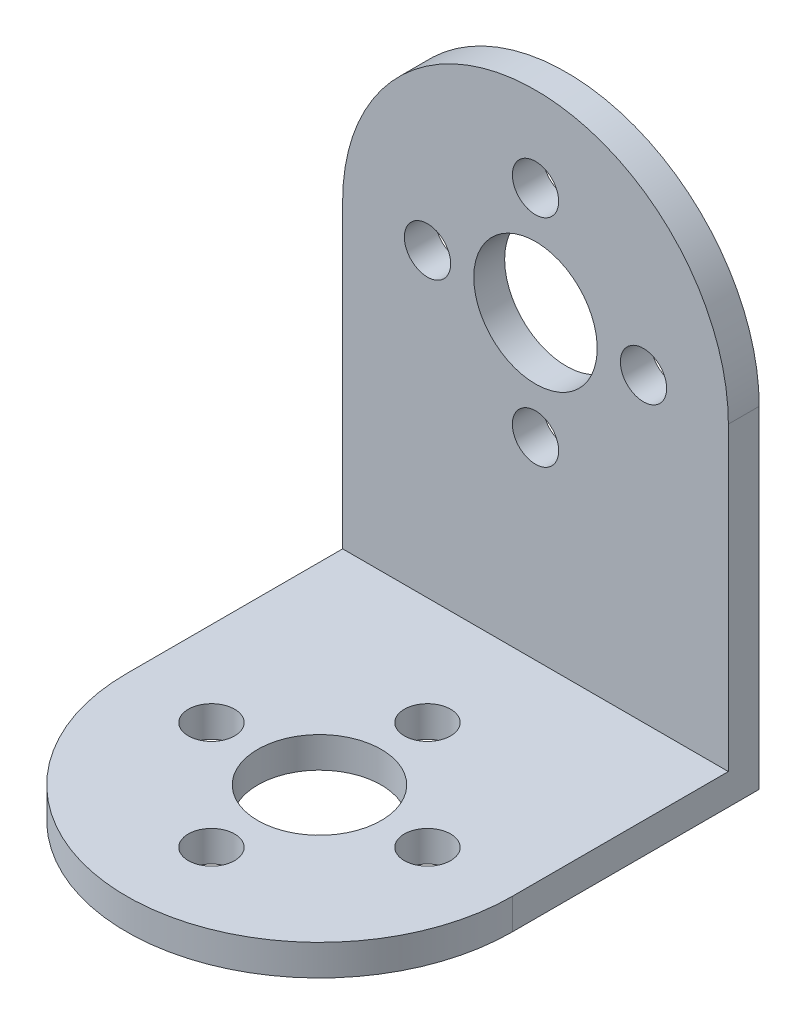
ISO-10303-21;
HEADER;
FILE_DESCRIPTION(('STEP AP214'),'2;1');
FILE_NAME('part.step','',(''),(''),'','','');
FILE_SCHEMA(('AUTOMOTIVE_DESIGN { 1 0 10303 214 1 1 1 1 }'));
ENDSEC;
DATA;
#1=APPLICATION_CONTEXT('core data for automotive mechanical design processes');
#2=APPLICATION_PROTOCOL_DEFINITION('international standard','automotive_design',2000,#1);
#3=PRODUCT_CONTEXT('',#1,'mechanical');
#4=PRODUCT('Part','Part','',(#3));
#5=PRODUCT_RELATED_PRODUCT_CATEGORY('part','',(#4));
#6=PRODUCT_DEFINITION_FORMATION('','',#4);
#7=PRODUCT_DEFINITION_CONTEXT('part definition',#1,'design');
#8=PRODUCT_DEFINITION('design','',#6,#7);
#9=PRODUCT_DEFINITION_SHAPE('','',#8);
#10=(LENGTH_UNIT() NAMED_UNIT(*) SI_UNIT(.MILLI.,.METRE.));
#11=(NAMED_UNIT(*) PLANE_ANGLE_UNIT() SI_UNIT($,.RADIAN.));
#12=(NAMED_UNIT(*) SI_UNIT($,.STERADIAN.) SOLID_ANGLE_UNIT());
#13=UNCERTAINTY_MEASURE_WITH_UNIT(LENGTH_MEASURE(1.E-05),#10,'distance_accuracy_value','');
#14=(GEOMETRIC_REPRESENTATION_CONTEXT(3) GLOBAL_UNCERTAINTY_ASSIGNED_CONTEXT((#13)) GLOBAL_UNIT_ASSIGNED_CONTEXT((#10,
#11,#12)) REPRESENTATION_CONTEXT('',''));
#15=CARTESIAN_POINT('',(0.,0.,0.));
#16=DIRECTION('',(0.,0.,1.));
#17=DIRECTION('',(1.,0.,0.));
#18=AXIS2_PLACEMENT_3D('',#15,#16,#17);
#19=CARTESIAN_POINT('',(0.,2.,7.));
#20=DIRECTION('',(0.,1.,0.));
#21=DIRECTION('',(0.,0.,1.));
#22=AXIS2_PLACEMENT_3D('',#19,#20,#21);
#23=PLANE('',#22);
#24=CARTESIAN_POINT('',(-7.,2.,7.));
#25=DIRECTION('',(0.,1.,0.));
#26=DIRECTION('',(0.,0.,1.));
#27=AXIS2_PLACEMENT_3D('',#24,#25,#26);
#28=CIRCLE('',#27,1.5);
#29=CARTESIAN_POINT('',(-7.,2.,8.5));
#30=VERTEX_POINT('',#29);
#31=EDGE_CURVE('E402',#30,#30,#28,.T.);
#32=ORIENTED_EDGE('',*,*,#31,.F.);
#33=EDGE_LOOP('',(#32));
#34=FACE_BOUND('',#33,.T.);
#35=CARTESIAN_POINT('',(0.,2.,0.));
#36=DIRECTION('',(0.,1.,0.));
#37=DIRECTION('',(0.,0.,1.));
#38=AXIS2_PLACEMENT_3D('',#35,#36,#37);
#39=CIRCLE('',#38,1.5);
#40=CARTESIAN_POINT('',(0.,2.,1.5));
#41=VERTEX_POINT('',#40);
#42=EDGE_CURVE('E412',#41,#41,#39,.T.);
#43=ORIENTED_EDGE('',*,*,#42,.F.);
#44=EDGE_LOOP('',(#43));
#45=FACE_BOUND('',#44,.T.);
#46=DIRECTION('',(0.,0.,1.));
#47=VECTOR('',#46,1.);
#48=CARTESIAN_POINT('',(-12.5,2.,7.));
#49=LINE('',#48,#47);
#50=CARTESIAN_POINT('',(-12.5,2.,-7.));
#51=VERTEX_POINT('',#50);
#52=CARTESIAN_POINT('',(-12.5,2.,7.));
#53=VERTEX_POINT('',#52);
#54=EDGE_CURVE('E93',#51,#53,#49,.T.);
#55=ORIENTED_EDGE('',*,*,#54,.T.);
#56=CARTESIAN_POINT('',(0.,2.,7.));
#57=DIRECTION('',(0.,1.,0.));
#58=DIRECTION('',(0.,0.,1.));
#59=AXIS2_PLACEMENT_3D('',#56,#57,#58);
#60=CIRCLE('',#59,12.5);
#61=CARTESIAN_POINT('',(12.5,2.,7.));
#62=VERTEX_POINT('',#61);
#63=EDGE_CURVE('E83',#53,#62,#60,.T.);
#64=ORIENTED_EDGE('',*,*,#63,.T.);
#65=DIRECTION('',(0.,0.,-1.));
#66=VECTOR('',#65,1.);
#67=CARTESIAN_POINT('',(12.5,2.,7.));
#68=LINE('',#67,#66);
#69=CARTESIAN_POINT('',(12.5,2.,-7.));
#70=VERTEX_POINT('',#69);
#71=EDGE_CURVE('E92',#62,#70,#68,.T.);
#72=ORIENTED_EDGE('',*,*,#71,.T.);
#73=DIRECTION('',(-1.,0.,0.));
#74=VECTOR('',#73,1.);
#75=CARTESIAN_POINT('',(12.5,2.,-7.));
#76=LINE('',#75,#74);
#77=EDGE_CURVE('E72',#70,#51,#76,.T.);
#78=ORIENTED_EDGE('',*,*,#77,.T.);
#79=EDGE_LOOP('',(#55,#64,#72,#78));
#80=FACE_BOUND('',#79,.T.);
#81=CARTESIAN_POINT('',(0.,2.,7.));
#82=DIRECTION('',(0.,1.,0.));
#83=DIRECTION('',(0.,0.,1.));
#84=AXIS2_PLACEMENT_3D('',#81,#82,#83);
#85=CIRCLE('',#84,4.);
#86=CARTESIAN_POINT('',(0.,2.,11.));
#87=VERTEX_POINT('',#86);
#88=EDGE_CURVE('E108',#87,#87,#85,.T.);
#89=ORIENTED_EDGE('',*,*,#88,.F.);
#90=EDGE_LOOP('',(#89));
#91=FACE_BOUND('',#90,.T.);
#92=CARTESIAN_POINT('',(7.,2.,7.));
#93=DIRECTION('',(0.,1.,0.));
#94=DIRECTION('',(0.,0.,1.));
#95=AXIS2_PLACEMENT_3D('',#92,#93,#94);
#96=CIRCLE('',#95,1.5);
#97=CARTESIAN_POINT('',(7.,2.,8.5));
#98=VERTEX_POINT('',#97);
#99=EDGE_CURVE('E407',#98,#98,#96,.T.);
#100=ORIENTED_EDGE('',*,*,#99,.F.);
#101=EDGE_LOOP('',(#100));
#102=FACE_BOUND('',#101,.T.);
#103=CARTESIAN_POINT('',(0.,2.,14.));
#104=DIRECTION('',(0.,1.,0.));
#105=DIRECTION('',(0.,0.,1.));
#106=AXIS2_PLACEMENT_3D('',#103,#104,#105);
#107=CIRCLE('',#106,1.5);
#108=CARTESIAN_POINT('',(0.,2.,15.5));
#109=VERTEX_POINT('',#108);
#110=EDGE_CURVE('E397',#109,#109,#107,.T.);
#111=ORIENTED_EDGE('',*,*,#110,.F.);
#112=EDGE_LOOP('',(#111));
#113=FACE_BOUND('',#112,.T.);
#114=ADVANCED_FACE('F36',(#34,#45,#80,#91,#102,#113),#23,.T.);
#115=CARTESIAN_POINT('',(0.,0.,7.));
#116=DIRECTION('',(0.,1.,0.));
#117=DIRECTION('',(0.,0.,1.));
#118=AXIS2_PLACEMENT_3D('',#115,#116,#117);
#119=PLANE('',#118);
#120=CARTESIAN_POINT('',(-7.,0.,7.));
#121=DIRECTION('',(0.,1.,0.));
#122=DIRECTION('',(0.,0.,1.));
#123=AXIS2_PLACEMENT_3D('',#120,#121,#122);
#124=CIRCLE('',#123,1.5);
#125=CARTESIAN_POINT('',(-7.,0.,8.5));
#126=VERTEX_POINT('',#125);
#127=EDGE_CURVE('E400',#126,#126,#124,.T.);
#128=ORIENTED_EDGE('',*,*,#127,.T.);
#129=EDGE_LOOP('',(#128));
#130=FACE_BOUND('',#129,.T.);
#131=CARTESIAN_POINT('',(0.,0.,0.));
#132=DIRECTION('',(0.,1.,0.));
#133=DIRECTION('',(0.,0.,1.));
#134=AXIS2_PLACEMENT_3D('',#131,#132,#133);
#135=CIRCLE('',#134,1.5);
#136=CARTESIAN_POINT('',(0.,0.,1.5));
#137=VERTEX_POINT('',#136);
#138=EDGE_CURVE('E410',#137,#137,#135,.T.);
#139=ORIENTED_EDGE('',*,*,#138,.T.);
#140=EDGE_LOOP('',(#139));
#141=FACE_BOUND('',#140,.T.);
#142=DIRECTION('',(0.,0.,1.));
#143=VECTOR('',#142,1.);
#144=CARTESIAN_POINT('',(-12.5,0.,7.));
#145=LINE('',#144,#143);
#146=CARTESIAN_POINT('',(-12.5,0.,-9.));
#147=VERTEX_POINT('',#146);
#148=CARTESIAN_POINT('',(-12.5,0.,7.));
#149=VERTEX_POINT('',#148);
#150=EDGE_CURVE('E101',#147,#149,#145,.T.);
#151=ORIENTED_EDGE('',*,*,#150,.F.);
#152=DIRECTION('',(-1.,0.,0.));
#153=VECTOR('',#152,1.);
#154=CARTESIAN_POINT('',(12.5,0.,-9.));
#155=LINE('',#154,#153);
#156=CARTESIAN_POINT('',(12.5,0.,-9.));
#157=VERTEX_POINT('',#156);
#158=EDGE_CURVE('E155',#157,#147,#155,.T.);
#159=ORIENTED_EDGE('',*,*,#158,.F.);
#160=DIRECTION('',(0.,0.,-1.));
#161=VECTOR('',#160,1.);
#162=CARTESIAN_POINT('',(12.5,0.,7.));
#163=LINE('',#162,#161);
#164=CARTESIAN_POINT('',(12.5,0.,7.));
#165=VERTEX_POINT('',#164);
#166=EDGE_CURVE('E98',#165,#157,#163,.T.);
#167=ORIENTED_EDGE('',*,*,#166,.F.);
#168=CARTESIAN_POINT('',(0.,0.,7.));
#169=DIRECTION('',(0.,1.,0.));
#170=DIRECTION('',(0.,0.,1.));
#171=AXIS2_PLACEMENT_3D('',#168,#169,#170);
#172=CIRCLE('',#171,12.5);
#173=EDGE_CURVE('E68',#149,#165,#172,.T.);
#174=ORIENTED_EDGE('',*,*,#173,.F.);
#175=EDGE_LOOP('',(#151,#159,#167,#174));
#176=FACE_BOUND('',#175,.T.);
#177=CARTESIAN_POINT('',(0.,0.,7.));
#178=DIRECTION('',(0.,1.,0.));
#179=DIRECTION('',(0.,0.,1.));
#180=AXIS2_PLACEMENT_3D('',#177,#178,#179);
#181=CIRCLE('',#180,4.);
#182=CARTESIAN_POINT('',(0.,0.,11.));
#183=VERTEX_POINT('',#182);
#184=EDGE_CURVE('E112',#183,#183,#181,.T.);
#185=ORIENTED_EDGE('',*,*,#184,.T.);
#186=EDGE_LOOP('',(#185));
#187=FACE_BOUND('',#186,.T.);
#188=CARTESIAN_POINT('',(7.,0.,7.));
#189=DIRECTION('',(0.,1.,0.));
#190=DIRECTION('',(0.,0.,1.));
#191=AXIS2_PLACEMENT_3D('',#188,#189,#190);
#192=CIRCLE('',#191,1.5);
#193=CARTESIAN_POINT('',(7.,0.,8.5));
#194=VERTEX_POINT('',#193);
#195=EDGE_CURVE('E393',#194,#194,#192,.T.);
#196=ORIENTED_EDGE('',*,*,#195,.T.);
#197=EDGE_LOOP('',(#196));
#198=FACE_BOUND('',#197,.T.);
#199=CARTESIAN_POINT('',(0.,0.,14.));
#200=DIRECTION('',(0.,1.,0.));
#201=DIRECTION('',(0.,0.,1.));
#202=AXIS2_PLACEMENT_3D('',#199,#200,#201);
#203=CIRCLE('',#202,1.5);
#204=CARTESIAN_POINT('',(0.,0.,15.5));
#205=VERTEX_POINT('',#204);
#206=EDGE_CURVE('E151',#205,#205,#203,.T.);
#207=ORIENTED_EDGE('',*,*,#206,.T.);
#208=EDGE_LOOP('',(#207));
#209=FACE_BOUND('',#208,.T.);
#210=ADVANCED_FACE('F209',(#130,#141,#176,#187,#198,#209),#119,.F.);
#211=CARTESIAN_POINT('',(-12.5,2.,7.));
#212=DIRECTION('',(1.,0.,0.));
#213=DIRECTION('',(0.,0.,-1.));
#214=AXIS2_PLACEMENT_3D('',#211,#212,#213);
#215=PLANE('',#214);
#216=ORIENTED_EDGE('',*,*,#150,.T.);
#217=DIRECTION('',(0.,-1.,0.));
#218=VECTOR('',#217,1.);
#219=CARTESIAN_POINT('',(-12.5,2.,7.));
#220=LINE('',#219,#218);
#221=EDGE_CURVE('E11',#53,#149,#220,.T.);
#222=ORIENTED_EDGE('',*,*,#221,.F.);
#223=ORIENTED_EDGE('',*,*,#54,.F.);
#224=DIRECTION('',(0.,1.,0.));
#225=VECTOR('',#224,1.);
#226=CARTESIAN_POINT('',(-12.5,0.,-7.));
#227=LINE('',#226,#225);
#228=CARTESIAN_POINT('',(-12.5,21.5,-7.));
#229=VERTEX_POINT('',#228);
#230=EDGE_CURVE('E55',#51,#229,#227,.T.);
#231=ORIENTED_EDGE('',*,*,#230,.T.);
#232=DIRECTION('',(0.,0.,1.));
#233=VECTOR('',#232,1.);
#234=CARTESIAN_POINT('',(-12.5,21.5,-9.));
#235=LINE('',#234,#233);
#236=CARTESIAN_POINT('',(-12.5,21.5,-9.));
#237=VERTEX_POINT('',#236);
#238=EDGE_CURVE('E138',#237,#229,#235,.T.);
#239=ORIENTED_EDGE('',*,*,#238,.F.);
#240=DIRECTION('',(0.,1.,0.));
#241=VECTOR('',#240,1.);
#242=CARTESIAN_POINT('',(-12.5,0.,-9.));
#243=LINE('',#242,#241);
#244=EDGE_CURVE('E105',#147,#237,#243,.T.);
#245=ORIENTED_EDGE('',*,*,#244,.F.);
#246=EDGE_LOOP('',(#216,#222,#223,#231,#239,#245));
#247=FACE_BOUND('',#246,.T.);
#248=ADVANCED_FACE('F38',(#247),#215,.F.);
#249=CARTESIAN_POINT('',(0.,2.,7.));
#250=DIRECTION('',(0.,-1.,0.));
#251=DIRECTION('',(0.,0.,-1.));
#252=AXIS2_PLACEMENT_3D('',#249,#250,#251);
#253=CYLINDRICAL_SURFACE('',#252,12.5);
#254=ORIENTED_EDGE('',*,*,#173,.T.);
#255=DIRECTION('',(0.,-1.,0.));
#256=VECTOR('',#255,1.);
#257=CARTESIAN_POINT('',(12.5,2.,7.));
#258=LINE('',#257,#256);
#259=EDGE_CURVE('E46',#62,#165,#258,.T.);
#260=ORIENTED_EDGE('',*,*,#259,.F.);
#261=ORIENTED_EDGE('',*,*,#63,.F.);
#262=ORIENTED_EDGE('',*,*,#221,.T.);
#263=EDGE_LOOP('',(#254,#260,#261,#262));
#264=FACE_BOUND('',#263,.T.);
#265=ADVANCED_FACE('F85',(#264),#253,.T.);
#266=CARTESIAN_POINT('',(12.5,2.,7.));
#267=DIRECTION('',(-1.,0.,0.));
#268=DIRECTION('',(0.,0.,1.));
#269=AXIS2_PLACEMENT_3D('',#266,#267,#268);
#270=PLANE('',#269);
#271=ORIENTED_EDGE('',*,*,#166,.T.);
#272=DIRECTION('',(0.,-1.,0.));
#273=VECTOR('',#272,1.);
#274=CARTESIAN_POINT('',(12.5,0.,-9.));
#275=LINE('',#274,#273);
#276=CARTESIAN_POINT('',(12.5,21.5,-9.));
#277=VERTEX_POINT('',#276);
#278=EDGE_CURVE('E149',#277,#157,#275,.T.);
#279=ORIENTED_EDGE('',*,*,#278,.F.);
#280=DIRECTION('',(0.,0.,1.));
#281=VECTOR('',#280,1.);
#282=CARTESIAN_POINT('',(12.5,21.5,-9.));
#283=LINE('',#282,#281);
#284=CARTESIAN_POINT('',(12.5,21.5,-7.));
#285=VERTEX_POINT('',#284);
#286=EDGE_CURVE('E128',#277,#285,#283,.T.);
#287=ORIENTED_EDGE('',*,*,#286,.T.);
#288=DIRECTION('',(0.,-1.,0.));
#289=VECTOR('',#288,1.);
#290=CARTESIAN_POINT('',(12.5,0.,-7.));
#291=LINE('',#290,#289);
#292=EDGE_CURVE('E125',#285,#70,#291,.T.);
#293=ORIENTED_EDGE('',*,*,#292,.T.);
#294=ORIENTED_EDGE('',*,*,#71,.F.);
#295=ORIENTED_EDGE('',*,*,#259,.T.);
#296=EDGE_LOOP('',(#271,#279,#287,#293,#294,#295));
#297=FACE_BOUND('',#296,.T.);
#298=ADVANCED_FACE('F123',(#297),#270,.F.);
#299=CARTESIAN_POINT('',(0.,2.,7.));
#300=DIRECTION('',(0.,-1.,0.));
#301=DIRECTION('',(0.,0.,-1.));
#302=AXIS2_PLACEMENT_3D('',#299,#300,#301);
#303=CYLINDRICAL_SURFACE('',#302,4.);
#304=ORIENTED_EDGE('',*,*,#88,.T.);
#305=EDGE_LOOP('',(#304));
#306=FACE_BOUND('',#305,.T.);
#307=ORIENTED_EDGE('',*,*,#184,.F.);
#308=EDGE_LOOP('',(#307));
#309=FACE_BOUND('',#308,.T.);
#310=ADVANCED_FACE('F220',(#306,#309),#303,.F.);
#311=CARTESIAN_POINT('',(0.,2.,0.));
#312=DIRECTION('',(0.,-1.,0.));
#313=DIRECTION('',(0.,0.,-1.));
#314=AXIS2_PLACEMENT_3D('',#311,#312,#313);
#315=CYLINDRICAL_SURFACE('',#314,1.5);
#316=ORIENTED_EDGE('',*,*,#42,.T.);
#317=EDGE_LOOP('',(#316));
#318=FACE_BOUND('',#317,.T.);
#319=ORIENTED_EDGE('',*,*,#138,.F.);
#320=EDGE_LOOP('',(#319));
#321=FACE_BOUND('',#320,.T.);
#322=ADVANCED_FACE('F269',(#318,#321),#315,.F.);
#323=CARTESIAN_POINT('',(7.,2.,7.));
#324=DIRECTION('',(0.,-1.,0.));
#325=DIRECTION('',(0.,0.,-1.));
#326=AXIS2_PLACEMENT_3D('',#323,#324,#325);
#327=CYLINDRICAL_SURFACE('',#326,1.5);
#328=ORIENTED_EDGE('',*,*,#99,.T.);
#329=EDGE_LOOP('',(#328));
#330=FACE_BOUND('',#329,.T.);
#331=ORIENTED_EDGE('',*,*,#195,.F.);
#332=EDGE_LOOP('',(#331));
#333=FACE_BOUND('',#332,.T.);
#334=ADVANCED_FACE('F259',(#330,#333),#327,.F.);
#335=CARTESIAN_POINT('',(-7.,2.,7.));
#336=DIRECTION('',(0.,-1.,0.));
#337=DIRECTION('',(0.,0.,-1.));
#338=AXIS2_PLACEMENT_3D('',#335,#336,#337);
#339=CYLINDRICAL_SURFACE('',#338,1.5);
#340=ORIENTED_EDGE('',*,*,#31,.T.);
#341=EDGE_LOOP('',(#340));
#342=FACE_BOUND('',#341,.T.);
#343=ORIENTED_EDGE('',*,*,#127,.F.);
#344=EDGE_LOOP('',(#343));
#345=FACE_BOUND('',#344,.T.);
#346=ADVANCED_FACE('F249',(#342,#345),#339,.F.);
#347=CARTESIAN_POINT('',(0.,2.,14.));
#348=DIRECTION('',(0.,-1.,0.));
#349=DIRECTION('',(0.,0.,-1.));
#350=AXIS2_PLACEMENT_3D('',#347,#348,#349);
#351=CYLINDRICAL_SURFACE('',#350,1.5);
#352=ORIENTED_EDGE('',*,*,#110,.T.);
#353=EDGE_LOOP('',(#352));
#354=FACE_BOUND('',#353,.T.);
#355=ORIENTED_EDGE('',*,*,#206,.F.);
#356=EDGE_LOOP('',(#355));
#357=FACE_BOUND('',#356,.T.);
#358=ADVANCED_FACE('F202',(#354,#357),#351,.F.);
#359=CARTESIAN_POINT('',(0.,21.5,-7.));
#360=DIRECTION('',(0.,0.,1.));
#361=DIRECTION('',(1.,0.,0.));
#362=AXIS2_PLACEMENT_3D('',#359,#360,#361);
#363=PLANE('',#362);
#364=CARTESIAN_POINT('',(7.,21.5,-7.));
#365=DIRECTION('',(0.,0.,-1.));
#366=DIRECTION('',(-1.,0.,0.));
#367=AXIS2_PLACEMENT_3D('',#364,#365,#366);
#368=CIRCLE('',#367,1.5);
#369=CARTESIAN_POINT('',(5.5,21.5,-7.));
#370=VERTEX_POINT('',#369);
#371=EDGE_CURVE('E180',#370,#370,#368,.T.);
#372=ORIENTED_EDGE('',*,*,#371,.T.);
#373=EDGE_LOOP('',(#372));
#374=FACE_BOUND('',#373,.T.);
#375=CARTESIAN_POINT('',(-7.,21.5,-7.));
#376=DIRECTION('',(0.,0.,-1.));
#377=DIRECTION('',(-1.,0.,0.));
#378=AXIS2_PLACEMENT_3D('',#375,#376,#377);
#379=CIRCLE('',#378,1.5);
#380=CARTESIAN_POINT('',(-8.5,21.5,-7.));
#381=VERTEX_POINT('',#380);
#382=EDGE_CURVE('E168',#381,#381,#379,.T.);
#383=ORIENTED_EDGE('',*,*,#382,.T.);
#384=EDGE_LOOP('',(#383));
#385=FACE_BOUND('',#384,.T.);
#386=CARTESIAN_POINT('',(0.,21.5,-7.));
#387=DIRECTION('',(0.,0.,-1.));
#388=DIRECTION('',(-1.,0.,0.));
#389=AXIS2_PLACEMENT_3D('',#386,#387,#388);
#390=CIRCLE('',#389,4.);
#391=CARTESIAN_POINT('',(-4.,21.5,-7.));
#392=VERTEX_POINT('',#391);
#393=EDGE_CURVE('E134',#392,#392,#390,.T.);
#394=ORIENTED_EDGE('',*,*,#393,.T.);
#395=EDGE_LOOP('',(#394));
#396=FACE_BOUND('',#395,.T.);
#397=CARTESIAN_POINT('',(0.,28.5,-7.));
#398=DIRECTION('',(0.,0.,-1.));
#399=DIRECTION('',(-1.,0.,0.));
#400=AXIS2_PLACEMENT_3D('',#397,#398,#399);
#401=CIRCLE('',#400,1.5);
#402=CARTESIAN_POINT('',(-1.5,28.5,-7.));
#403=VERTEX_POINT('',#402);
#404=EDGE_CURVE('E162',#403,#403,#401,.T.);
#405=ORIENTED_EDGE('',*,*,#404,.T.);
#406=EDGE_LOOP('',(#405));
#407=FACE_BOUND('',#406,.T.);
#408=CARTESIAN_POINT('',(0.,14.5,-7.));
#409=DIRECTION('',(0.,0.,-1.));
#410=DIRECTION('',(-1.,0.,0.));
#411=AXIS2_PLACEMENT_3D('',#408,#409,#410);
#412=CIRCLE('',#411,1.5);
#413=CARTESIAN_POINT('',(-1.5,14.5,-7.));
#414=VERTEX_POINT('',#413);
#415=EDGE_CURVE('E174',#414,#414,#412,.T.);
#416=ORIENTED_EDGE('',*,*,#415,.T.);
#417=EDGE_LOOP('',(#416));
#418=FACE_BOUND('',#417,.T.);
#419=ORIENTED_EDGE('',*,*,#77,.F.);
#420=ORIENTED_EDGE('',*,*,#292,.F.);
#421=CARTESIAN_POINT('',(0.,21.5,-7.));
#422=DIRECTION('',(0.,0.,-1.));
#423=DIRECTION('',(1.,0.,0.));
#424=AXIS2_PLACEMENT_3D('',#421,#422,#423);
#425=CIRCLE('',#424,12.5);
#426=EDGE_CURVE('E131',#229,#285,#425,.T.);
#427=ORIENTED_EDGE('',*,*,#426,.F.);
#428=ORIENTED_EDGE('',*,*,#230,.F.);
#429=EDGE_LOOP('',(#419,#420,#427,#428));
#430=FACE_BOUND('',#429,.T.);
#431=ADVANCED_FACE('F192',(#374,#385,#396,#407,#418,#430),#363,.T.);
#432=CARTESIAN_POINT('',(0.,21.5,-9.));
#433=DIRECTION('',(0.,0.,1.));
#434=DIRECTION('',(1.,0.,0.));
#435=AXIS2_PLACEMENT_3D('',#432,#433,#434);
#436=PLANE('',#435);
#437=CARTESIAN_POINT('',(0.,14.5,-9.));
#438=DIRECTION('',(0.,0.,-1.));
#439=DIRECTION('',(-1.,0.,0.));
#440=AXIS2_PLACEMENT_3D('',#437,#438,#439);
#441=CIRCLE('',#440,1.5);
#442=CARTESIAN_POINT('',(-1.5,14.5,-9.));
#443=VERTEX_POINT('',#442);
#444=EDGE_CURVE('E171',#443,#443,#441,.T.);
#445=ORIENTED_EDGE('',*,*,#444,.F.);
#446=EDGE_LOOP('',(#445));
#447=FACE_BOUND('',#446,.T.);
#448=CARTESIAN_POINT('',(0.,28.5,-9.));
#449=DIRECTION('',(0.,0.,-1.));
#450=DIRECTION('',(-1.,0.,0.));
#451=AXIS2_PLACEMENT_3D('',#448,#449,#450);
#452=CIRCLE('',#451,1.5);
#453=CARTESIAN_POINT('',(-1.5,28.5,-9.));
#454=VERTEX_POINT('',#453);
#455=EDGE_CURVE('E160',#454,#454,#452,.T.);
#456=ORIENTED_EDGE('',*,*,#455,.F.);
#457=EDGE_LOOP('',(#456));
#458=FACE_BOUND('',#457,.T.);
#459=ORIENTED_EDGE('',*,*,#278,.T.);
#460=ORIENTED_EDGE('',*,*,#158,.T.);
#461=ORIENTED_EDGE('',*,*,#244,.T.);
#462=CARTESIAN_POINT('',(0.,21.5,-9.));
#463=DIRECTION('',(0.,0.,-1.));
#464=DIRECTION('',(1.,0.,0.));
#465=AXIS2_PLACEMENT_3D('',#462,#463,#464);
#466=CIRCLE('',#465,12.5);
#467=EDGE_CURVE('E144',#237,#277,#466,.T.);
#468=ORIENTED_EDGE('',*,*,#467,.T.);
#469=EDGE_LOOP('',(#459,#460,#461,#468));
#470=FACE_BOUND('',#469,.T.);
#471=CARTESIAN_POINT('',(0.,21.5,-9.));
#472=DIRECTION('',(0.,0.,-1.));
#473=DIRECTION('',(-1.,0.,0.));
#474=AXIS2_PLACEMENT_3D('',#471,#472,#473);
#475=CIRCLE('',#474,4.);
#476=CARTESIAN_POINT('',(-4.,21.5,-9.));
#477=VERTEX_POINT('',#476);
#478=EDGE_CURVE('E129',#477,#477,#475,.T.);
#479=ORIENTED_EDGE('',*,*,#478,.F.);
#480=EDGE_LOOP('',(#479));
#481=FACE_BOUND('',#480,.T.);
#482=CARTESIAN_POINT('',(-7.,21.5,-9.));
#483=DIRECTION('',(0.,0.,-1.));
#484=DIRECTION('',(-1.,0.,0.));
#485=AXIS2_PLACEMENT_3D('',#482,#483,#484);
#486=CIRCLE('',#485,1.5);
#487=CARTESIAN_POINT('',(-8.5,21.5,-9.));
#488=VERTEX_POINT('',#487);
#489=EDGE_CURVE('E165',#488,#488,#486,.T.);
#490=ORIENTED_EDGE('',*,*,#489,.F.);
#491=EDGE_LOOP('',(#490));
#492=FACE_BOUND('',#491,.T.);
#493=CARTESIAN_POINT('',(7.,21.5,-9.));
#494=DIRECTION('',(0.,0.,-1.));
#495=DIRECTION('',(-1.,0.,0.));
#496=AXIS2_PLACEMENT_3D('',#493,#494,#495);
#497=CIRCLE('',#496,1.5);
#498=CARTESIAN_POINT('',(5.5,21.5,-9.));
#499=VERTEX_POINT('',#498);
#500=EDGE_CURVE('E177',#499,#499,#497,.T.);
#501=ORIENTED_EDGE('',*,*,#500,.F.);
#502=EDGE_LOOP('',(#501));
#503=FACE_BOUND('',#502,.T.);
#504=ADVANCED_FACE('F189',(#447,#458,#470,#481,#492,#503),#436,.F.);
#505=CARTESIAN_POINT('',(0.,21.5,-9.));
#506=DIRECTION('',(0.,0.,1.));
#507=DIRECTION('',(1.,0.,0.));
#508=AXIS2_PLACEMENT_3D('',#505,#506,#507);
#509=CYLINDRICAL_SURFACE('',#508,12.5);
#510=ORIENTED_EDGE('',*,*,#426,.T.);
#511=ORIENTED_EDGE('',*,*,#286,.F.);
#512=ORIENTED_EDGE('',*,*,#467,.F.);
#513=ORIENTED_EDGE('',*,*,#238,.T.);
#514=EDGE_LOOP('',(#510,#511,#512,#513));
#515=FACE_BOUND('',#514,.T.);
#516=ADVANCED_FACE('F191',(#515),#509,.T.);
#517=CARTESIAN_POINT('',(0.,21.5,-9.));
#518=DIRECTION('',(0.,0.,1.));
#519=DIRECTION('',(1.,0.,0.));
#520=AXIS2_PLACEMENT_3D('',#517,#518,#519);
#521=CYLINDRICAL_SURFACE('',#520,4.);
#522=ORIENTED_EDGE('',*,*,#478,.T.);
#523=EDGE_LOOP('',(#522));
#524=FACE_BOUND('',#523,.T.);
#525=ORIENTED_EDGE('',*,*,#393,.F.);
#526=EDGE_LOOP('',(#525));
#527=FACE_BOUND('',#526,.T.);
#528=ADVANCED_FACE('F199',(#524,#527),#521,.F.);
#529=CARTESIAN_POINT('',(0.,28.5,-9.));
#530=DIRECTION('',(0.,0.,1.));
#531=DIRECTION('',(1.,0.,0.));
#532=AXIS2_PLACEMENT_3D('',#529,#530,#531);
#533=CYLINDRICAL_SURFACE('',#532,1.5);
#534=ORIENTED_EDGE('',*,*,#455,.T.);
#535=EDGE_LOOP('',(#534));
#536=FACE_BOUND('',#535,.T.);
#537=ORIENTED_EDGE('',*,*,#404,.F.);
#538=EDGE_LOOP('',(#537));
#539=FACE_BOUND('',#538,.T.);
#540=ADVANCED_FACE('F326',(#536,#539),#533,.F.);
#541=CARTESIAN_POINT('',(-7.,21.5,-9.));
#542=DIRECTION('',(0.,0.,1.));
#543=DIRECTION('',(1.,0.,0.));
#544=AXIS2_PLACEMENT_3D('',#541,#542,#543);
#545=CYLINDRICAL_SURFACE('',#544,1.5);
#546=ORIENTED_EDGE('',*,*,#489,.T.);
#547=EDGE_LOOP('',(#546));
#548=FACE_BOUND('',#547,.T.);
#549=ORIENTED_EDGE('',*,*,#382,.F.);
#550=EDGE_LOOP('',(#549));
#551=FACE_BOUND('',#550,.T.);
#552=ADVANCED_FACE('F334',(#548,#551),#545,.F.);
#553=CARTESIAN_POINT('',(0.,14.5,-9.));
#554=DIRECTION('',(0.,0.,1.));
#555=DIRECTION('',(1.,0.,0.));
#556=AXIS2_PLACEMENT_3D('',#553,#554,#555);
#557=CYLINDRICAL_SURFACE('',#556,1.5);
#558=ORIENTED_EDGE('',*,*,#444,.T.);
#559=EDGE_LOOP('',(#558));
#560=FACE_BOUND('',#559,.T.);
#561=ORIENTED_EDGE('',*,*,#415,.F.);
#562=EDGE_LOOP('',(#561));
#563=FACE_BOUND('',#562,.T.);
#564=ADVANCED_FACE('F343',(#560,#563),#557,.F.);
#565=CARTESIAN_POINT('',(7.,21.5,-9.));
#566=DIRECTION('',(0.,0.,1.));
#567=DIRECTION('',(1.,0.,0.));
#568=AXIS2_PLACEMENT_3D('',#565,#566,#567);
#569=CYLINDRICAL_SURFACE('',#568,1.5);
#570=ORIENTED_EDGE('',*,*,#500,.T.);
#571=EDGE_LOOP('',(#570));
#572=FACE_BOUND('',#571,.T.);
#573=ORIENTED_EDGE('',*,*,#371,.F.);
#574=EDGE_LOOP('',(#573));
#575=FACE_BOUND('',#574,.T.);
#576=ADVANCED_FACE('F186',(#572,#575),#569,.F.);
#577=CLOSED_SHELL('',(#114,#210,#248,#265,#298,#310,#322,#334,#346,#358,#431,#504,#516,#528,
#540,#552,#564,#576));
#578=MANIFOLD_SOLID_BREP('B2',#577);
#579=ADVANCED_BREP_SHAPE_REPRESENTATION('',(#18,#578),#14);
#580=SHAPE_DEFINITION_REPRESENTATION(#9,#579);
ENDSEC;
END-ISO-10303-21;
